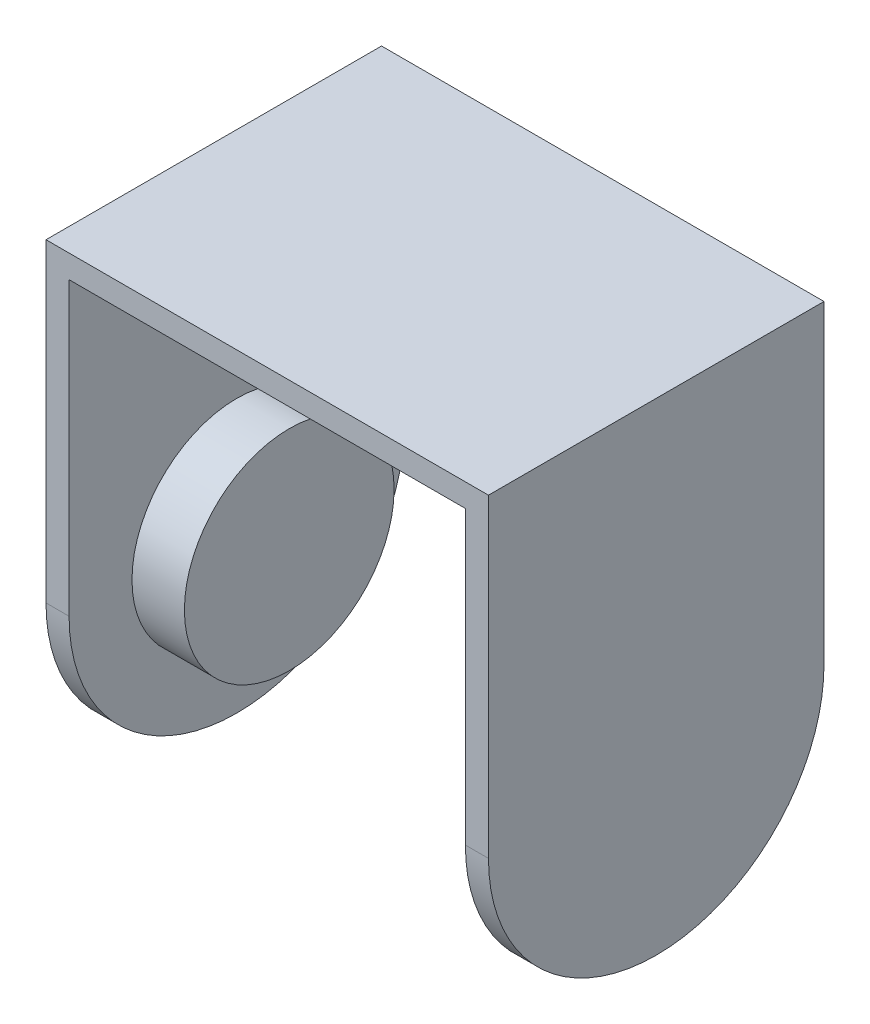
ISO-10303-21;
HEADER;
FILE_DESCRIPTION(('STEP AP214'),'2;1');
FILE_NAME('part.step','',(''),(''),'','','');
FILE_SCHEMA(('AUTOMOTIVE_DESIGN { 1 0 10303 214 1 1 1 1 }'));
ENDSEC;
DATA;
#1=APPLICATION_CONTEXT('core data for automotive mechanical design processes');
#2=APPLICATION_PROTOCOL_DEFINITION('international standard','automotive_design',2000,#1);
#3=PRODUCT_CONTEXT('',#1,'mechanical');
#4=PRODUCT('Part','Part','',(#3));
#5=PRODUCT_RELATED_PRODUCT_CATEGORY('part','',(#4));
#6=PRODUCT_DEFINITION_FORMATION('','',#4);
#7=PRODUCT_DEFINITION_CONTEXT('part definition',#1,'design');
#8=PRODUCT_DEFINITION('design','',#6,#7);
#9=PRODUCT_DEFINITION_SHAPE('','',#8);
#10=(LENGTH_UNIT() NAMED_UNIT(*) SI_UNIT(.MILLI.,.METRE.));
#11=(NAMED_UNIT(*) PLANE_ANGLE_UNIT() SI_UNIT($,.RADIAN.));
#12=(NAMED_UNIT(*) SI_UNIT($,.STERADIAN.) SOLID_ANGLE_UNIT());
#13=UNCERTAINTY_MEASURE_WITH_UNIT(LENGTH_MEASURE(1.E-05),#10,'distance_accuracy_value','');
#14=(GEOMETRIC_REPRESENTATION_CONTEXT(3) GLOBAL_UNCERTAINTY_ASSIGNED_CONTEXT((#13)) GLOBAL_UNIT_ASSIGNED_CONTEXT((#10,
#11,#12)) REPRESENTATION_CONTEXT('',''));
#15=CARTESIAN_POINT('',(0.,0.,0.));
#16=DIRECTION('',(0.,0.,1.));
#17=DIRECTION('',(1.,0.,0.));
#18=AXIS2_PLACEMENT_3D('',#15,#16,#17);
#19=CARTESIAN_POINT('',(2.2,43.8,32.));
#20=DIRECTION('',(-1.,0.,0.));
#21=DIRECTION('',(0.,-1.,0.));
#22=AXIS2_PLACEMENT_3D('',#19,#20,#21);
#23=PLANE('',#22);
#24=CARTESIAN_POINT('',(2.2,16.,16.));
#25=DIRECTION('',(-1.,0.,0.));
#26=DIRECTION('',(0.,-1.,0.));
#27=AXIS2_PLACEMENT_3D('',#24,#25,#26);
#28=CIRCLE('',#27,10.);
#29=CARTESIAN_POINT('',(2.20000000000001,6.,16.));
#30=VERTEX_POINT('',#29);
#31=EDGE_CURVE('E11',#30,#30,#28,.F.);
#32=ORIENTED_EDGE('',*,*,#31,.F.);
#33=EDGE_LOOP('',(#32));
#34=FACE_BOUND('',#33,.T.);
#35=CARTESIAN_POINT('',(2.2,16.,16.));
#36=DIRECTION('',(-1.,0.,0.));
#37=DIRECTION('',(0.,-1.,0.));
#38=AXIS2_PLACEMENT_3D('',#35,#36,#37);
#39=CIRCLE('',#38,16.);
#40=CARTESIAN_POINT('',(2.2,16.,32.));
#41=VERTEX_POINT('',#40);
#42=CARTESIAN_POINT('',(2.20000000000001,0.,16.));
#43=VERTEX_POINT('',#42);
#44=EDGE_CURVE('E61',#41,#43,#39,.F.);
#45=ORIENTED_EDGE('',*,*,#44,.T.);
#46=CARTESIAN_POINT('',(2.2,16.,16.));
#47=DIRECTION('',(-1.,0.,0.));
#48=DIRECTION('',(0.,-1.,0.));
#49=AXIS2_PLACEMENT_3D('',#46,#47,#48);
#50=CIRCLE('',#49,16.);
#51=CARTESIAN_POINT('',(2.2,16.,0.));
#52=VERTEX_POINT('',#51);
#53=EDGE_CURVE('E185',#43,#52,#50,.F.);
#54=ORIENTED_EDGE('',*,*,#53,.T.);
#55=DIRECTION('',(0.,1.,0.));
#56=VECTOR('',#55,1.);
#57=CARTESIAN_POINT('',(2.2,43.8,0.));
#58=LINE('',#57,#56);
#59=CARTESIAN_POINT('',(2.2,43.8,0.));
#60=VERTEX_POINT('',#59);
#61=EDGE_CURVE('E129',#52,#60,#58,.T.);
#62=ORIENTED_EDGE('',*,*,#61,.T.);
#63=DIRECTION('',(0.,0.,-1.));
#64=VECTOR('',#63,1.);
#65=CARTESIAN_POINT('',(2.2,43.8,32.));
#66=LINE('',#65,#64);
#67=CARTESIAN_POINT('',(2.2,43.8,32.));
#68=VERTEX_POINT('',#67);
#69=EDGE_CURVE('E127',#68,#60,#66,.T.);
#70=ORIENTED_EDGE('',*,*,#69,.F.);
#71=DIRECTION('',(0.,1.,0.));
#72=VECTOR('',#71,1.);
#73=CARTESIAN_POINT('',(2.2,43.8,32.));
#74=LINE('',#73,#72);
#75=EDGE_CURVE('E114',#41,#68,#74,.T.);
#76=ORIENTED_EDGE('',*,*,#75,.F.);
#77=EDGE_LOOP('',(#45,#54,#62,#70,#76));
#78=FACE_BOUND('',#77,.T.);
#79=ADVANCED_FACE('F39',(#34,#78),#23,.F.);
#80=CARTESIAN_POINT('',(40.,43.8,32.));
#81=DIRECTION('',(0.,1.,0.));
#82=DIRECTION('',(-1.,0.,0.));
#83=AXIS2_PLACEMENT_3D('',#80,#81,#82);
#84=PLANE('',#83);
#85=DIRECTION('',(1.,0.,0.));
#86=VECTOR('',#85,1.);
#87=CARTESIAN_POINT('',(40.,43.8,0.));
#88=LINE('',#87,#86);
#89=CARTESIAN_POINT('',(40.,43.8,0.));
#90=VERTEX_POINT('',#89);
#91=EDGE_CURVE('E150',#60,#90,#88,.T.);
#92=ORIENTED_EDGE('',*,*,#91,.T.);
#93=DIRECTION('',(0.,0.,-1.));
#94=VECTOR('',#93,1.);
#95=CARTESIAN_POINT('',(40.,43.8,32.));
#96=LINE('',#95,#94);
#97=CARTESIAN_POINT('',(40.,43.8,32.));
#98=VERTEX_POINT('',#97);
#99=EDGE_CURVE('E132',#98,#90,#96,.T.);
#100=ORIENTED_EDGE('',*,*,#99,.F.);
#101=DIRECTION('',(1.,0.,0.));
#102=VECTOR('',#101,1.);
#103=CARTESIAN_POINT('',(40.,43.8,32.));
#104=LINE('',#103,#102);
#105=EDGE_CURVE('E119',#68,#98,#104,.T.);
#106=ORIENTED_EDGE('',*,*,#105,.F.);
#107=ORIENTED_EDGE('',*,*,#69,.T.);
#108=EDGE_LOOP('',(#92,#100,#106,#107));
#109=FACE_BOUND('',#108,.T.);
#110=ADVANCED_FACE('F134',(#109),#84,.F.);
#111=CARTESIAN_POINT('',(40.,0.,32.));
#112=DIRECTION('',(1.,0.,0.));
#113=DIRECTION('',(0.,0.,-1.));
#114=AXIS2_PLACEMENT_3D('',#111,#112,#113);
#115=PLANE('',#114);
#116=CARTESIAN_POINT('',(40.,16.,16.));
#117=DIRECTION('',(1.,0.,0.));
#118=DIRECTION('',(0.,1.,0.));
#119=AXIS2_PLACEMENT_3D('',#116,#117,#118);
#120=CIRCLE('',#119,10.);
#121=CARTESIAN_POINT('',(40.,26.,16.));
#122=VERTEX_POINT('',#121);
#123=EDGE_CURVE('E201',#122,#122,#120,.T.);
#124=ORIENTED_EDGE('',*,*,#123,.T.);
#125=EDGE_LOOP('',(#124));
#126=FACE_BOUND('',#125,.T.);
#127=CARTESIAN_POINT('',(40.,16.,16.));
#128=DIRECTION('',(1.,0.,0.));
#129=DIRECTION('',(0.,0.,-1.));
#130=AXIS2_PLACEMENT_3D('',#127,#128,#129);
#131=CIRCLE('',#130,16.);
#132=CARTESIAN_POINT('',(40.,16.,0.));
#133=VERTEX_POINT('',#132);
#134=CARTESIAN_POINT('',(40.,0.,16.));
#135=VERTEX_POINT('',#134);
#136=EDGE_CURVE('E175',#133,#135,#131,.F.);
#137=ORIENTED_EDGE('',*,*,#136,.T.);
#138=CARTESIAN_POINT('',(40.,16.,16.));
#139=DIRECTION('',(1.,0.,0.));
#140=DIRECTION('',(0.,0.,-1.));
#141=AXIS2_PLACEMENT_3D('',#138,#139,#140);
#142=CIRCLE('',#141,16.);
#143=CARTESIAN_POINT('',(40.,16.,32.));
#144=VERTEX_POINT('',#143);
#145=EDGE_CURVE('E177',#135,#144,#142,.F.);
#146=ORIENTED_EDGE('',*,*,#145,.T.);
#147=DIRECTION('',(0.,-1.,0.));
#148=VECTOR('',#147,1.);
#149=CARTESIAN_POINT('',(40.,0.,32.));
#150=LINE('',#149,#148);
#151=EDGE_CURVE('E137',#98,#144,#150,.T.);
#152=ORIENTED_EDGE('',*,*,#151,.F.);
#153=ORIENTED_EDGE('',*,*,#99,.T.);
#154=DIRECTION('',(0.,-1.,0.));
#155=VECTOR('',#154,1.);
#156=CARTESIAN_POINT('',(40.,0.,0.));
#157=LINE('',#156,#155);
#158=EDGE_CURVE('E153',#90,#133,#157,.T.);
#159=ORIENTED_EDGE('',*,*,#158,.T.);
#160=EDGE_LOOP('',(#137,#146,#152,#153,#159));
#161=FACE_BOUND('',#160,.T.);
#162=ADVANCED_FACE('F207',(#126,#161),#115,.F.);
#163=CARTESIAN_POINT('',(42.2,46.,32.));
#164=DIRECTION('',(-1.,0.,0.));
#165=DIRECTION('',(0.,-1.,0.));
#166=AXIS2_PLACEMENT_3D('',#163,#164,#165);
#167=PLANE('',#166);
#168=DIRECTION('',(0.,1.,0.));
#169=VECTOR('',#168,1.);
#170=CARTESIAN_POINT('',(42.2,46.,32.));
#171=LINE('',#170,#169);
#172=CARTESIAN_POINT('',(42.2,16.,32.));
#173=VERTEX_POINT('',#172);
#174=CARTESIAN_POINT('',(42.2,46.,32.));
#175=VERTEX_POINT('',#174);
#176=EDGE_CURVE('E139',#173,#175,#171,.T.);
#177=ORIENTED_EDGE('',*,*,#176,.F.);
#178=CARTESIAN_POINT('',(42.2,16.,16.));
#179=DIRECTION('',(-1.,0.,0.));
#180=DIRECTION('',(0.,-1.,0.));
#181=AXIS2_PLACEMENT_3D('',#178,#179,#180);
#182=CIRCLE('',#181,16.);
#183=CARTESIAN_POINT('',(42.2,0.,16.));
#184=VERTEX_POINT('',#183);
#185=EDGE_CURVE('E173',#173,#184,#182,.F.);
#186=ORIENTED_EDGE('',*,*,#185,.T.);
#187=CARTESIAN_POINT('',(42.2,16.,16.));
#188=DIRECTION('',(-1.,0.,0.));
#189=DIRECTION('',(0.,-1.,0.));
#190=AXIS2_PLACEMENT_3D('',#187,#188,#189);
#191=CIRCLE('',#190,16.);
#192=CARTESIAN_POINT('',(42.2,16.,0.));
#193=VERTEX_POINT('',#192);
#194=EDGE_CURVE('E171',#184,#193,#191,.F.);
#195=ORIENTED_EDGE('',*,*,#194,.T.);
#196=DIRECTION('',(0.,1.,0.));
#197=VECTOR('',#196,1.);
#198=CARTESIAN_POINT('',(42.2,46.,0.));
#199=LINE('',#198,#197);
#200=CARTESIAN_POINT('',(42.2,46.,0.));
#201=VERTEX_POINT('',#200);
#202=EDGE_CURVE('E156',#193,#201,#199,.T.);
#203=ORIENTED_EDGE('',*,*,#202,.T.);
#204=DIRECTION('',(0.,0.,-1.));
#205=VECTOR('',#204,1.);
#206=CARTESIAN_POINT('',(42.2,46.,32.));
#207=LINE('',#206,#205);
#208=EDGE_CURVE('E163',#175,#201,#207,.T.);
#209=ORIENTED_EDGE('',*,*,#208,.F.);
#210=EDGE_LOOP('',(#177,#186,#195,#203,#209));
#211=FACE_BOUND('',#210,.T.);
#212=ADVANCED_FACE('F273',(#211),#167,.F.);
#213=CARTESIAN_POINT('',(0.,46.,32.));
#214=DIRECTION('',(0.,-1.,0.));
#215=DIRECTION('',(0.,0.,-1.));
#216=AXIS2_PLACEMENT_3D('',#213,#214,#215);
#217=PLANE('',#216);
#218=DIRECTION('',(-1.,0.,0.));
#219=VECTOR('',#218,1.);
#220=CARTESIAN_POINT('',(0.,46.,0.));
#221=LINE('',#220,#219);
#222=CARTESIAN_POINT('',(0.,46.,0.));
#223=VERTEX_POINT('',#222);
#224=EDGE_CURVE('E158',#201,#223,#221,.T.);
#225=ORIENTED_EDGE('',*,*,#224,.T.);
#226=DIRECTION('',(0.,0.,-1.));
#227=VECTOR('',#226,1.);
#228=CARTESIAN_POINT('',(0.,46.,32.));
#229=LINE('',#228,#227);
#230=CARTESIAN_POINT('',(0.,46.,32.));
#231=VERTEX_POINT('',#230);
#232=EDGE_CURVE('E148',#231,#223,#229,.T.);
#233=ORIENTED_EDGE('',*,*,#232,.F.);
#234=DIRECTION('',(-1.,0.,0.));
#235=VECTOR('',#234,1.);
#236=CARTESIAN_POINT('',(0.,46.,32.));
#237=LINE('',#236,#235);
#238=EDGE_CURVE('E144',#175,#231,#237,.T.);
#239=ORIENTED_EDGE('',*,*,#238,.F.);
#240=ORIENTED_EDGE('',*,*,#208,.T.);
#241=EDGE_LOOP('',(#225,#233,#239,#240));
#242=FACE_BOUND('',#241,.T.);
#243=ADVANCED_FACE('F262',(#242),#217,.F.);
#244=CARTESIAN_POINT('',(0.,0.,32.));
#245=DIRECTION('',(1.,0.,0.));
#246=DIRECTION('',(0.,0.,-1.));
#247=AXIS2_PLACEMENT_3D('',#244,#245,#246);
#248=PLANE('',#247);
#249=DIRECTION('',(0.,-1.,0.));
#250=VECTOR('',#249,1.);
#251=CARTESIAN_POINT('',(0.,0.,0.));
#252=LINE('',#251,#250);
#253=CARTESIAN_POINT('',(0.,16.,0.));
#254=VERTEX_POINT('',#253);
#255=EDGE_CURVE('E124',#223,#254,#252,.T.);
#256=ORIENTED_EDGE('',*,*,#255,.T.);
#257=CARTESIAN_POINT('',(0.,16.,16.));
#258=DIRECTION('',(1.,0.,0.));
#259=DIRECTION('',(0.,0.,-1.));
#260=AXIS2_PLACEMENT_3D('',#257,#258,#259);
#261=CIRCLE('',#260,16.);
#262=CARTESIAN_POINT('',(0.,0.,16.));
#263=VERTEX_POINT('',#262);
#264=EDGE_CURVE('E47',#254,#263,#261,.F.);
#265=ORIENTED_EDGE('',*,*,#264,.T.);
#266=CARTESIAN_POINT('',(0.,16.,16.));
#267=DIRECTION('',(1.,0.,0.));
#268=DIRECTION('',(0.,0.,-1.));
#269=AXIS2_PLACEMENT_3D('',#266,#267,#268);
#270=CIRCLE('',#269,16.);
#271=CARTESIAN_POINT('',(0.,16.,32.));
#272=VERTEX_POINT('',#271);
#273=EDGE_CURVE('E187',#263,#272,#270,.F.);
#274=ORIENTED_EDGE('',*,*,#273,.T.);
#275=DIRECTION('',(0.,-1.,0.));
#276=VECTOR('',#275,1.);
#277=CARTESIAN_POINT('',(0.,0.,32.));
#278=LINE('',#277,#276);
#279=EDGE_CURVE('E146',#231,#272,#278,.T.);
#280=ORIENTED_EDGE('',*,*,#279,.F.);
#281=ORIENTED_EDGE('',*,*,#232,.T.);
#282=EDGE_LOOP('',(#256,#265,#274,#280,#281));
#283=FACE_BOUND('',#282,.T.);
#284=ADVANCED_FACE('F257',(#283),#248,.F.);
#285=CARTESIAN_POINT('',(0.,0.,32.));
#286=DIRECTION('',(0.,0.,-1.));
#287=DIRECTION('',(-1.,0.,0.));
#288=AXIS2_PLACEMENT_3D('',#285,#286,#287);
#289=PLANE('',#288);
#290=ORIENTED_EDGE('',*,*,#151,.T.);
#291=DIRECTION('',(1.,0.,0.));
#292=VECTOR('',#291,1.);
#293=CARTESIAN_POINT('',(0.,16.,32.));
#294=LINE('',#293,#292);
#295=EDGE_CURVE('E168',#144,#173,#294,.T.);
#296=ORIENTED_EDGE('',*,*,#295,.T.);
#297=ORIENTED_EDGE('',*,*,#176,.T.);
#298=ORIENTED_EDGE('',*,*,#238,.T.);
#299=ORIENTED_EDGE('',*,*,#279,.T.);
#300=DIRECTION('',(1.,0.,0.));
#301=VECTOR('',#300,1.);
#302=CARTESIAN_POINT('',(0.,16.,32.));
#303=LINE('',#302,#301);
#304=EDGE_CURVE('E123',#272,#41,#303,.T.);
#305=ORIENTED_EDGE('',*,*,#304,.T.);
#306=ORIENTED_EDGE('',*,*,#75,.T.);
#307=ORIENTED_EDGE('',*,*,#105,.T.);
#308=EDGE_LOOP('',(#290,#296,#297,#298,#299,#305,#306,#307));
#309=FACE_BOUND('',#308,.T.);
#310=ADVANCED_FACE('F117',(#309),#289,.F.);
#311=CARTESIAN_POINT('',(0.,0.,0.));
#312=DIRECTION('',(0.,0.,-1.));
#313=DIRECTION('',(-1.,0.,0.));
#314=AXIS2_PLACEMENT_3D('',#311,#312,#313);
#315=PLANE('',#314);
#316=ORIENTED_EDGE('',*,*,#202,.F.);
#317=DIRECTION('',(1.,0.,0.));
#318=VECTOR('',#317,1.);
#319=CARTESIAN_POINT('',(40.,16.,0.));
#320=LINE('',#319,#318);
#321=EDGE_CURVE('E182',#193,#133,#320,.F.);
#322=ORIENTED_EDGE('',*,*,#321,.T.);
#323=ORIENTED_EDGE('',*,*,#158,.F.);
#324=ORIENTED_EDGE('',*,*,#91,.F.);
#325=ORIENTED_EDGE('',*,*,#61,.F.);
#326=DIRECTION('',(1.,0.,0.));
#327=VECTOR('',#326,1.);
#328=CARTESIAN_POINT('',(0.,16.,0.));
#329=LINE('',#328,#327);
#330=EDGE_CURVE('E179',#52,#254,#329,.F.);
#331=ORIENTED_EDGE('',*,*,#330,.T.);
#332=ORIENTED_EDGE('',*,*,#255,.F.);
#333=ORIENTED_EDGE('',*,*,#224,.F.);
#334=EDGE_LOOP('',(#316,#322,#323,#324,#325,#331,#332,#333));
#335=FACE_BOUND('',#334,.T.);
#336=ADVANCED_FACE('F242',(#335),#315,.T.);
#337=CARTESIAN_POINT('',(42.2,16.,16.));
#338=DIRECTION('',(-1.,0.,0.));
#339=DIRECTION('',(0.,-1.,0.));
#340=AXIS2_PLACEMENT_3D('',#337,#338,#339);
#341=CYLINDRICAL_SURFACE('',#340,16.);
#342=DIRECTION('',(1.,0.,0.));
#343=VECTOR('',#342,1.);
#344=CARTESIAN_POINT('',(42.2,0.,16.));
#345=LINE('',#344,#343);
#346=EDGE_CURVE('E151',#135,#184,#345,.T.);
#347=ORIENTED_EDGE('',*,*,#346,.F.);
#348=ORIENTED_EDGE('',*,*,#136,.F.);
#349=ORIENTED_EDGE('',*,*,#321,.F.);
#350=ORIENTED_EDGE('',*,*,#194,.F.);
#351=EDGE_LOOP('',(#347,#348,#349,#350));
#352=FACE_BOUND('',#351,.T.);
#353=ADVANCED_FACE('F239',(#352),#341,.T.);
#354=CARTESIAN_POINT('',(0.,16.,16.));
#355=DIRECTION('',(1.,0.,0.));
#356=DIRECTION('',(0.,1.,0.));
#357=AXIS2_PLACEMENT_3D('',#354,#355,#356);
#358=CYLINDRICAL_SURFACE('',#357,16.);
#359=ORIENTED_EDGE('',*,*,#145,.F.);
#360=ORIENTED_EDGE('',*,*,#346,.T.);
#361=ORIENTED_EDGE('',*,*,#185,.F.);
#362=ORIENTED_EDGE('',*,*,#295,.F.);
#363=EDGE_LOOP('',(#359,#360,#361,#362));
#364=FACE_BOUND('',#363,.T.);
#365=ADVANCED_FACE('F236',(#364),#358,.T.);
#366=CARTESIAN_POINT('',(0.,16.,16.));
#367=DIRECTION('',(1.,0.,0.));
#368=DIRECTION('',(0.,1.,0.));
#369=AXIS2_PLACEMENT_3D('',#366,#367,#368);
#370=CYLINDRICAL_SURFACE('',#369,16.);
#371=ORIENTED_EDGE('',*,*,#304,.F.);
#372=ORIENTED_EDGE('',*,*,#273,.F.);
#373=DIRECTION('',(1.,0.,0.));
#374=VECTOR('',#373,1.);
#375=CARTESIAN_POINT('',(2.20000000000001,0.,16.));
#376=LINE('',#375,#374);
#377=EDGE_CURVE('E191',#43,#263,#376,.F.);
#378=ORIENTED_EDGE('',*,*,#377,.F.);
#379=ORIENTED_EDGE('',*,*,#44,.F.);
#380=EDGE_LOOP('',(#371,#372,#378,#379));
#381=FACE_BOUND('',#380,.T.);
#382=ADVANCED_FACE('F41',(#381),#370,.T.);
#383=CARTESIAN_POINT('',(2.20000000000001,16.,16.));
#384=DIRECTION('',(-1.,0.,0.));
#385=DIRECTION('',(0.,-1.,0.));
#386=AXIS2_PLACEMENT_3D('',#383,#384,#385);
#387=CYLINDRICAL_SURFACE('',#386,16.);
#388=ORIENTED_EDGE('',*,*,#264,.F.);
#389=ORIENTED_EDGE('',*,*,#330,.F.);
#390=ORIENTED_EDGE('',*,*,#53,.F.);
#391=ORIENTED_EDGE('',*,*,#377,.T.);
#392=EDGE_LOOP('',(#388,#389,#390,#391));
#393=FACE_BOUND('',#392,.T.);
#394=ADVANCED_FACE('F244',(#393),#387,.T.);
#395=CARTESIAN_POINT('',(7.2,16.,16.));
#396=DIRECTION('',(-1.,0.,0.));
#397=DIRECTION('',(0.,-1.,0.));
#398=AXIS2_PLACEMENT_3D('',#395,#396,#397);
#399=CYLINDRICAL_SURFACE('',#398,10.);
#400=CARTESIAN_POINT('',(7.2,16.,16.));
#401=DIRECTION('',(1.,0.,0.));
#402=DIRECTION('',(0.,1.,0.));
#403=AXIS2_PLACEMENT_3D('',#400,#401,#402);
#404=CIRCLE('',#403,10.);
#405=CARTESIAN_POINT('',(7.2,26.,16.));
#406=VERTEX_POINT('',#405);
#407=EDGE_CURVE('E193',#406,#406,#404,.T.);
#408=ORIENTED_EDGE('',*,*,#407,.F.);
#409=EDGE_LOOP('',(#408));
#410=FACE_BOUND('',#409,.T.);
#411=ORIENTED_EDGE('',*,*,#31,.T.);
#412=EDGE_LOOP('',(#411));
#413=FACE_BOUND('',#412,.T.);
#414=ADVANCED_FACE('F222',(#410,#413),#399,.T.);
#415=CARTESIAN_POINT('',(7.2,16.,16.));
#416=DIRECTION('',(1.,0.,0.));
#417=DIRECTION('',(0.,1.,0.));
#418=AXIS2_PLACEMENT_3D('',#415,#416,#417);
#419=PLANE('',#418);
#420=ORIENTED_EDGE('',*,*,#407,.T.);
#421=EDGE_LOOP('',(#420));
#422=FACE_BOUND('',#421,.T.);
#423=ADVANCED_FACE('F213',(#422),#419,.T.);
#424=CARTESIAN_POINT('',(35.,16.,16.));
#425=DIRECTION('',(1.,0.,0.));
#426=DIRECTION('',(0.,0.,-1.));
#427=AXIS2_PLACEMENT_3D('',#424,#425,#426);
#428=CYLINDRICAL_SURFACE('',#427,10.);
#429=CARTESIAN_POINT('',(35.,16.,16.));
#430=DIRECTION('',(1.,0.,0.));
#431=DIRECTION('',(0.,1.,0.));
#432=AXIS2_PLACEMENT_3D('',#429,#430,#431);
#433=CIRCLE('',#432,10.);
#434=CARTESIAN_POINT('',(35.,26.,16.));
#435=VERTEX_POINT('',#434);
#436=EDGE_CURVE('E197',#435,#435,#433,.T.);
#437=ORIENTED_EDGE('',*,*,#436,.T.);
#438=EDGE_LOOP('',(#437));
#439=FACE_BOUND('',#438,.T.);
#440=ORIENTED_EDGE('',*,*,#123,.F.);
#441=EDGE_LOOP('',(#440));
#442=FACE_BOUND('',#441,.T.);
#443=ADVANCED_FACE('F210',(#439,#442),#428,.T.);
#444=CARTESIAN_POINT('',(35.,16.,16.));
#445=DIRECTION('',(-1.,0.,0.));
#446=DIRECTION('',(0.,1.,0.));
#447=AXIS2_PLACEMENT_3D('',#444,#445,#446);
#448=PLANE('',#447);
#449=ORIENTED_EDGE('',*,*,#436,.F.);
#450=EDGE_LOOP('',(#449));
#451=FACE_BOUND('',#450,.T.);
#452=ADVANCED_FACE('F212',(#451),#448,.T.);
#453=CLOSED_SHELL('',(#79,#110,#162,#212,#243,#284,#310,#336,#353,#365,#382,#394,#414,#423,#443,#452));
#454=MANIFOLD_SOLID_BREP('B2',#453);
#455=ADVANCED_BREP_SHAPE_REPRESENTATION('',(#18,#454),#14);
#456=SHAPE_DEFINITION_REPRESENTATION(#9,#455);
ENDSEC;
END-ISO-10303-21;
